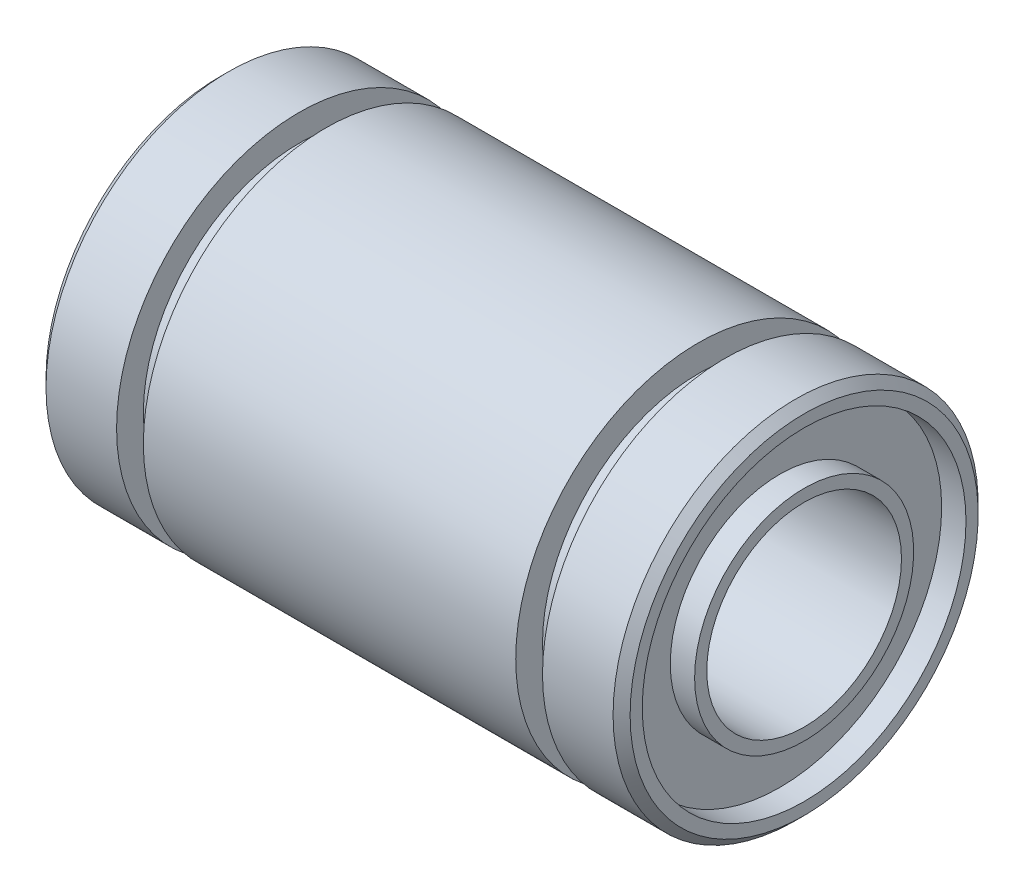
ISO-10303-21;
HEADER;
FILE_DESCRIPTION(('STEP AP214'),'2;1');
FILE_NAME('part.step','',(''),(''),'','','');
FILE_SCHEMA(('AUTOMOTIVE_DESIGN { 1 0 10303 214 1 1 1 1 }'));
ENDSEC;
DATA;
#1=APPLICATION_CONTEXT('core data for automotive mechanical design processes');
#2=APPLICATION_PROTOCOL_DEFINITION('international standard','automotive_design',2000,#1);
#3=PRODUCT_CONTEXT('',#1,'mechanical');
#4=PRODUCT('Part','Part','',(#3));
#5=PRODUCT_RELATED_PRODUCT_CATEGORY('part','',(#4));
#6=PRODUCT_DEFINITION_FORMATION('','',#4);
#7=PRODUCT_DEFINITION_CONTEXT('part definition',#1,'design');
#8=PRODUCT_DEFINITION('design','',#6,#7);
#9=PRODUCT_DEFINITION_SHAPE('','',#8);
#10=(LENGTH_UNIT() NAMED_UNIT(*) SI_UNIT(.MILLI.,.METRE.));
#11=(NAMED_UNIT(*) PLANE_ANGLE_UNIT() SI_UNIT($,.RADIAN.));
#12=(NAMED_UNIT(*) SI_UNIT($,.STERADIAN.) SOLID_ANGLE_UNIT());
#13=UNCERTAINTY_MEASURE_WITH_UNIT(LENGTH_MEASURE(1.E-05),#10,'distance_accuracy_value','');
#14=(GEOMETRIC_REPRESENTATION_CONTEXT(3) GLOBAL_UNCERTAINTY_ASSIGNED_CONTEXT((#13)) GLOBAL_UNIT_ASSIGNED_CONTEXT((#10,
#11,#12)) REPRESENTATION_CONTEXT('',''));
#15=CARTESIAN_POINT('',(0.,0.,0.));
#16=DIRECTION('',(0.,0.,1.));
#17=DIRECTION('',(1.,0.,0.));
#18=AXIS2_PLACEMENT_3D('',#15,#16,#17);
#19=CARTESIAN_POINT('',(11.65,0.,0.));
#20=DIRECTION('',(-1.,0.,0.));
#21=DIRECTION('',(0.,0.,1.));
#22=AXIS2_PLACEMENT_3D('',#19,#20,#21);
#23=CONICAL_SURFACE('',#22,7.5,0.78539816339745);
#24=CARTESIAN_POINT('',(12.,0.,0.));
#25=DIRECTION('',(-1.,0.,0.));
#26=DIRECTION('',(0.,0.,1.));
#27=AXIS2_PLACEMENT_3D('',#24,#25,#26);
#28=CIRCLE('',#27,7.15);
#29=CARTESIAN_POINT('',(12.,0.,7.15));
#30=VERTEX_POINT('',#29);
#31=EDGE_CURVE('E116',#30,#30,#28,.T.);
#32=ORIENTED_EDGE('',*,*,#31,.T.);
#33=EDGE_LOOP('',(#32));
#34=FACE_BOUND('',#33,.T.);
#35=CARTESIAN_POINT('',(11.65,0.,0.));
#36=DIRECTION('',(-1.,0.,0.));
#37=DIRECTION('',(0.,0.,1.));
#38=AXIS2_PLACEMENT_3D('',#35,#36,#37);
#39=CIRCLE('',#38,7.5);
#40=CARTESIAN_POINT('',(11.65,0.,7.5));
#41=VERTEX_POINT('',#40);
#42=EDGE_CURVE('E12',#41,#41,#39,.T.);
#43=ORIENTED_EDGE('',*,*,#42,.F.);
#44=EDGE_LOOP('',(#43));
#45=FACE_BOUND('',#44,.T.);
#46=ADVANCED_FACE('F46',(#34,#45),#23,.T.);
#47=CARTESIAN_POINT('',(-45.6895053247726,0.,0.));
#48=DIRECTION('',(-1.,0.,0.));
#49=DIRECTION('',(0.,0.,1.));
#50=AXIS2_PLACEMENT_3D('',#47,#48,#49);
#51=CYLINDRICAL_SURFACE('',#50,7.5);
#52=CARTESIAN_POINT('',(8.75000000000001,0.,0.));
#53=DIRECTION('',(-1.,0.,0.));
#54=DIRECTION('',(0.,0.,1.));
#55=AXIS2_PLACEMENT_3D('',#52,#53,#54);
#56=CIRCLE('',#55,7.5);
#57=CARTESIAN_POINT('',(8.75000000000001,0.,7.5));
#58=VERTEX_POINT('',#57);
#59=EDGE_CURVE('E52',#58,#58,#56,.T.);
#60=ORIENTED_EDGE('',*,*,#59,.F.);
#61=EDGE_LOOP('',(#60));
#62=FACE_BOUND('',#61,.T.);
#63=ORIENTED_EDGE('',*,*,#42,.T.);
#64=EDGE_LOOP('',(#63));
#65=FACE_BOUND('',#64,.T.);
#66=ADVANCED_FACE('F134',(#62,#65),#51,.T.);
#67=CARTESIAN_POINT('',(8.75000000000001,0.,0.));
#68=DIRECTION('',(1.,0.,0.));
#69=DIRECTION('',(0.,0.,-1.));
#70=AXIS2_PLACEMENT_3D('',#67,#68,#69);
#71=PLANE('',#70);
#72=CARTESIAN_POINT('',(8.75000000000001,0.,0.));
#73=DIRECTION('',(-1.,0.,0.));
#74=DIRECTION('',(0.,0.,1.));
#75=AXIS2_PLACEMENT_3D('',#72,#73,#74);
#76=CIRCLE('',#75,6.4);
#77=CARTESIAN_POINT('',(8.75000000000001,0.,6.4));
#78=VERTEX_POINT('',#77);
#79=EDGE_CURVE('E56',#78,#78,#76,.T.);
#80=ORIENTED_EDGE('',*,*,#79,.F.);
#81=EDGE_LOOP('',(#80));
#82=FACE_BOUND('',#81,.T.);
#83=ORIENTED_EDGE('',*,*,#59,.T.);
#84=EDGE_LOOP('',(#83));
#85=FACE_BOUND('',#84,.T.);
#86=ADVANCED_FACE('F138',(#82,#85),#71,.F.);
#87=CARTESIAN_POINT('',(-45.6895053247726,0.,0.));
#88=DIRECTION('',(-1.,0.,0.));
#89=DIRECTION('',(0.,0.,1.));
#90=AXIS2_PLACEMENT_3D('',#87,#88,#89);
#91=CYLINDRICAL_SURFACE('',#90,6.4);
#92=CARTESIAN_POINT('',(7.65,0.,0.));
#93=DIRECTION('',(-1.,0.,0.));
#94=DIRECTION('',(0.,0.,1.));
#95=AXIS2_PLACEMENT_3D('',#92,#93,#94);
#96=CIRCLE('',#95,6.4);
#97=CARTESIAN_POINT('',(7.65,0.,6.4));
#98=VERTEX_POINT('',#97);
#99=EDGE_CURVE('E60',#98,#98,#96,.T.);
#100=ORIENTED_EDGE('',*,*,#99,.F.);
#101=EDGE_LOOP('',(#100));
#102=FACE_BOUND('',#101,.T.);
#103=ORIENTED_EDGE('',*,*,#79,.T.);
#104=EDGE_LOOP('',(#103));
#105=FACE_BOUND('',#104,.T.);
#106=ADVANCED_FACE('F143',(#102,#105),#91,.T.);
#107=CARTESIAN_POINT('',(7.65,0.,0.));
#108=DIRECTION('',(-1.,0.,0.));
#109=DIRECTION('',(0.,0.,1.));
#110=AXIS2_PLACEMENT_3D('',#107,#108,#109);
#111=PLANE('',#110);
#112=CARTESIAN_POINT('',(7.65,0.,0.));
#113=DIRECTION('',(-1.,0.,0.));
#114=DIRECTION('',(0.,0.,1.));
#115=AXIS2_PLACEMENT_3D('',#112,#113,#114);
#116=CIRCLE('',#115,7.5);
#117=CARTESIAN_POINT('',(7.65,0.,7.5));
#118=VERTEX_POINT('',#117);
#119=EDGE_CURVE('E65',#118,#118,#116,.T.);
#120=ORIENTED_EDGE('',*,*,#119,.F.);
#121=EDGE_LOOP('',(#120));
#122=FACE_BOUND('',#121,.T.);
#123=ORIENTED_EDGE('',*,*,#99,.T.);
#124=EDGE_LOOP('',(#123));
#125=FACE_BOUND('',#124,.T.);
#126=ADVANCED_FACE('F149',(#122,#125),#111,.F.);
#127=CARTESIAN_POINT('',(-45.6895053247726,0.,0.));
#128=DIRECTION('',(-1.,0.,0.));
#129=DIRECTION('',(0.,0.,1.));
#130=AXIS2_PLACEMENT_3D('',#127,#128,#129);
#131=CYLINDRICAL_SURFACE('',#130,7.5);
#132=ORIENTED_EDGE('',*,*,#119,.T.);
#133=EDGE_LOOP('',(#132));
#134=FACE_BOUND('',#133,.T.);
#135=CARTESIAN_POINT('',(-7.65,0.,0.));
#136=DIRECTION('',(-1.,0.,0.));
#137=DIRECTION('',(0.,0.,1.));
#138=AXIS2_PLACEMENT_3D('',#135,#136,#137);
#139=CIRCLE('',#138,7.5);
#140=CARTESIAN_POINT('',(-7.65,0.,7.5));
#141=VERTEX_POINT('',#140);
#142=EDGE_CURVE('E68',#141,#141,#139,.T.);
#143=ORIENTED_EDGE('',*,*,#142,.F.);
#144=EDGE_LOOP('',(#143));
#145=FACE_BOUND('',#144,.T.);
#146=ADVANCED_FACE('F153',(#134,#145),#131,.T.);
#147=CARTESIAN_POINT('',(-7.65,0.,0.));
#148=DIRECTION('',(-1.,0.,0.));
#149=DIRECTION('',(0.,0.,1.));
#150=AXIS2_PLACEMENT_3D('',#147,#148,#149);
#151=PLANE('',#150);
#152=ORIENTED_EDGE('',*,*,#142,.T.);
#153=EDGE_LOOP('',(#152));
#154=FACE_BOUND('',#153,.T.);
#155=CARTESIAN_POINT('',(-7.65,0.,0.));
#156=DIRECTION('',(-1.,0.,0.));
#157=DIRECTION('',(0.,0.,1.));
#158=AXIS2_PLACEMENT_3D('',#155,#156,#157);
#159=CIRCLE('',#158,6.4);
#160=CARTESIAN_POINT('',(-7.65,0.,6.4));
#161=VERTEX_POINT('',#160);
#162=EDGE_CURVE('E71',#161,#161,#159,.T.);
#163=ORIENTED_EDGE('',*,*,#162,.F.);
#164=EDGE_LOOP('',(#163));
#165=FACE_BOUND('',#164,.T.);
#166=ADVANCED_FACE('F157',(#154,#165),#151,.T.);
#167=CARTESIAN_POINT('',(-45.6895053247726,0.,0.));
#168=DIRECTION('',(-1.,0.,0.));
#169=DIRECTION('',(0.,0.,1.));
#170=AXIS2_PLACEMENT_3D('',#167,#168,#169);
#171=CYLINDRICAL_SURFACE('',#170,6.4);
#172=ORIENTED_EDGE('',*,*,#162,.T.);
#173=EDGE_LOOP('',(#172));
#174=FACE_BOUND('',#173,.T.);
#175=CARTESIAN_POINT('',(-8.74999999999999,0.,0.));
#176=DIRECTION('',(-1.,0.,0.));
#177=DIRECTION('',(0.,0.,1.));
#178=AXIS2_PLACEMENT_3D('',#175,#176,#177);
#179=CIRCLE('',#178,6.4);
#180=CARTESIAN_POINT('',(-8.74999999999999,0.,6.4));
#181=VERTEX_POINT('',#180);
#182=EDGE_CURVE('E74',#181,#181,#179,.T.);
#183=ORIENTED_EDGE('',*,*,#182,.F.);
#184=EDGE_LOOP('',(#183));
#185=FACE_BOUND('',#184,.T.);
#186=ADVANCED_FACE('F161',(#174,#185),#171,.T.);
#187=CARTESIAN_POINT('',(-8.75,0.,0.));
#188=DIRECTION('',(1.,0.,0.));
#189=DIRECTION('',(0.,0.,-1.));
#190=AXIS2_PLACEMENT_3D('',#187,#188,#189);
#191=PLANE('',#190);
#192=ORIENTED_EDGE('',*,*,#182,.T.);
#193=EDGE_LOOP('',(#192));
#194=FACE_BOUND('',#193,.T.);
#195=CARTESIAN_POINT('',(-8.74999999999999,0.,0.));
#196=DIRECTION('',(-1.,0.,0.));
#197=DIRECTION('',(0.,0.,1.));
#198=AXIS2_PLACEMENT_3D('',#195,#196,#197);
#199=CIRCLE('',#198,7.5);
#200=CARTESIAN_POINT('',(-8.74999999999999,0.,7.5));
#201=VERTEX_POINT('',#200);
#202=EDGE_CURVE('E77',#201,#201,#199,.T.);
#203=ORIENTED_EDGE('',*,*,#202,.F.);
#204=EDGE_LOOP('',(#203));
#205=FACE_BOUND('',#204,.T.);
#206=ADVANCED_FACE('F165',(#194,#205),#191,.T.);
#207=CARTESIAN_POINT('',(-45.6895053247726,0.,0.));
#208=DIRECTION('',(-1.,0.,0.));
#209=DIRECTION('',(0.,0.,1.));
#210=AXIS2_PLACEMENT_3D('',#207,#208,#209);
#211=CYLINDRICAL_SURFACE('',#210,7.5);
#212=ORIENTED_EDGE('',*,*,#202,.T.);
#213=EDGE_LOOP('',(#212));
#214=FACE_BOUND('',#213,.T.);
#215=CARTESIAN_POINT('',(-11.65,0.,0.));
#216=DIRECTION('',(-1.,0.,0.));
#217=DIRECTION('',(0.,0.,1.));
#218=AXIS2_PLACEMENT_3D('',#215,#216,#217);
#219=CIRCLE('',#218,7.5);
#220=CARTESIAN_POINT('',(-11.65,0.,7.5));
#221=VERTEX_POINT('',#220);
#222=EDGE_CURVE('E80',#221,#221,#219,.T.);
#223=ORIENTED_EDGE('',*,*,#222,.F.);
#224=EDGE_LOOP('',(#223));
#225=FACE_BOUND('',#224,.T.);
#226=ADVANCED_FACE('F169',(#214,#225),#211,.T.);
#227=CARTESIAN_POINT('',(-11.65,0.,0.));
#228=DIRECTION('',(1.,0.,0.));
#229=DIRECTION('',(0.,0.,-1.));
#230=AXIS2_PLACEMENT_3D('',#227,#228,#229);
#231=CONICAL_SURFACE('',#230,7.5,0.78539816339745);
#232=CARTESIAN_POINT('',(-12.,0.,0.));
#233=DIRECTION('',(-1.,0.,0.));
#234=DIRECTION('',(0.,0.,1.));
#235=AXIS2_PLACEMENT_3D('',#232,#233,#234);
#236=CIRCLE('',#235,7.15);
#237=CARTESIAN_POINT('',(-12.,0.,7.15));
#238=VERTEX_POINT('',#237);
#239=EDGE_CURVE('E83',#238,#238,#236,.T.);
#240=ORIENTED_EDGE('',*,*,#239,.F.);
#241=EDGE_LOOP('',(#240));
#242=FACE_BOUND('',#241,.T.);
#243=ORIENTED_EDGE('',*,*,#222,.T.);
#244=EDGE_LOOP('',(#243));
#245=FACE_BOUND('',#244,.T.);
#246=ADVANCED_FACE('F173',(#242,#245),#231,.T.);
#247=CARTESIAN_POINT('',(-12.,0.,0.));
#248=DIRECTION('',(1.,0.,0.));
#249=DIRECTION('',(0.,0.,-1.));
#250=AXIS2_PLACEMENT_3D('',#247,#248,#249);
#251=PLANE('',#250);
#252=CARTESIAN_POINT('',(-12.,0.,0.));
#253=DIRECTION('',(-1.,0.,0.));
#254=DIRECTION('',(0.,0.,1.));
#255=AXIS2_PLACEMENT_3D('',#252,#253,#254);
#256=CIRCLE('',#255,6.65);
#257=CARTESIAN_POINT('',(-12.,0.,6.65));
#258=VERTEX_POINT('',#257);
#259=EDGE_CURVE('E86',#258,#258,#256,.T.);
#260=ORIENTED_EDGE('',*,*,#259,.F.);
#261=EDGE_LOOP('',(#260));
#262=FACE_BOUND('',#261,.T.);
#263=ORIENTED_EDGE('',*,*,#239,.T.);
#264=EDGE_LOOP('',(#263));
#265=FACE_BOUND('',#264,.T.);
#266=ADVANCED_FACE('F177',(#262,#265),#251,.F.);
#267=CARTESIAN_POINT('',(-45.6895053247726,0.,0.));
#268=DIRECTION('',(-1.,0.,0.));
#269=DIRECTION('',(0.,0.,1.));
#270=AXIS2_PLACEMENT_3D('',#267,#268,#269);
#271=CYLINDRICAL_SURFACE('',#270,6.65);
#272=CARTESIAN_POINT('',(-11.,0.,0.));
#273=DIRECTION('',(-1.,0.,0.));
#274=DIRECTION('',(0.,0.,1.));
#275=AXIS2_PLACEMENT_3D('',#272,#273,#274);
#276=CIRCLE('',#275,6.65);
#277=CARTESIAN_POINT('',(-11.,0.,6.65));
#278=VERTEX_POINT('',#277);
#279=EDGE_CURVE('E89',#278,#278,#276,.T.);
#280=ORIENTED_EDGE('',*,*,#279,.F.);
#281=EDGE_LOOP('',(#280));
#282=FACE_BOUND('',#281,.T.);
#283=ORIENTED_EDGE('',*,*,#259,.T.);
#284=EDGE_LOOP('',(#283));
#285=FACE_BOUND('',#284,.T.);
#286=ADVANCED_FACE('F181',(#282,#285),#271,.F.);
#287=CARTESIAN_POINT('',(-11.,0.,0.));
#288=DIRECTION('',(1.,0.,0.));
#289=DIRECTION('',(0.,0.,-1.));
#290=AXIS2_PLACEMENT_3D('',#287,#288,#289);
#291=PLANE('',#290);
#292=CARTESIAN_POINT('',(-11.,0.,0.));
#293=DIRECTION('',(-1.,0.,0.));
#294=DIRECTION('',(0.,0.,1.));
#295=AXIS2_PLACEMENT_3D('',#292,#293,#294);
#296=CIRCLE('',#295,4.5);
#297=CARTESIAN_POINT('',(-11.,0.,4.5));
#298=VERTEX_POINT('',#297);
#299=EDGE_CURVE('E92',#298,#298,#296,.T.);
#300=ORIENTED_EDGE('',*,*,#299,.F.);
#301=EDGE_LOOP('',(#300));
#302=FACE_BOUND('',#301,.T.);
#303=ORIENTED_EDGE('',*,*,#279,.T.);
#304=EDGE_LOOP('',(#303));
#305=FACE_BOUND('',#304,.T.);
#306=ADVANCED_FACE('F185',(#302,#305),#291,.F.);
#307=CARTESIAN_POINT('',(-45.6895053247726,0.,0.));
#308=DIRECTION('',(-1.,0.,0.));
#309=DIRECTION('',(0.,0.,1.));
#310=AXIS2_PLACEMENT_3D('',#307,#308,#309);
#311=CYLINDRICAL_SURFACE('',#310,4.5);
#312=CARTESIAN_POINT('',(-12.,0.,0.));
#313=DIRECTION('',(-1.,0.,0.));
#314=DIRECTION('',(0.,0.,1.));
#315=AXIS2_PLACEMENT_3D('',#312,#313,#314);
#316=CIRCLE('',#315,4.5);
#317=CARTESIAN_POINT('',(-12.,0.,4.5));
#318=VERTEX_POINT('',#317);
#319=EDGE_CURVE('E95',#318,#318,#316,.T.);
#320=ORIENTED_EDGE('',*,*,#319,.F.);
#321=EDGE_LOOP('',(#320));
#322=FACE_BOUND('',#321,.T.);
#323=ORIENTED_EDGE('',*,*,#299,.T.);
#324=EDGE_LOOP('',(#323));
#325=FACE_BOUND('',#324,.T.);
#326=ADVANCED_FACE('F189',(#322,#325),#311,.T.);
#327=CARTESIAN_POINT('',(-12.,0.,0.));
#328=DIRECTION('',(1.,0.,0.));
#329=DIRECTION('',(0.,0.,-1.));
#330=AXIS2_PLACEMENT_3D('',#327,#328,#329);
#331=PLANE('',#330);
#332=CARTESIAN_POINT('',(-12.,0.,0.));
#333=DIRECTION('',(-1.,0.,0.));
#334=DIRECTION('',(0.,0.,1.));
#335=AXIS2_PLACEMENT_3D('',#332,#333,#334);
#336=CIRCLE('',#335,4.);
#337=CARTESIAN_POINT('',(-12.,0.,4.));
#338=VERTEX_POINT('',#337);
#339=EDGE_CURVE('E98',#338,#338,#336,.T.);
#340=ORIENTED_EDGE('',*,*,#339,.F.);
#341=EDGE_LOOP('',(#340));
#342=FACE_BOUND('',#341,.T.);
#343=ORIENTED_EDGE('',*,*,#319,.T.);
#344=EDGE_LOOP('',(#343));
#345=FACE_BOUND('',#344,.T.);
#346=ADVANCED_FACE('F193',(#342,#345),#331,.F.);
#347=CARTESIAN_POINT('',(-45.6895053247726,0.,0.));
#348=DIRECTION('',(-1.,0.,0.));
#349=DIRECTION('',(0.,0.,1.));
#350=AXIS2_PLACEMENT_3D('',#347,#348,#349);
#351=CYLINDRICAL_SURFACE('',#350,4.);
#352=CARTESIAN_POINT('',(12.,0.,0.));
#353=DIRECTION('',(-1.,0.,0.));
#354=DIRECTION('',(0.,0.,1.));
#355=AXIS2_PLACEMENT_3D('',#352,#353,#354);
#356=CIRCLE('',#355,4.);
#357=CARTESIAN_POINT('',(12.,0.,4.));
#358=VERTEX_POINT('',#357);
#359=EDGE_CURVE('E101',#358,#358,#356,.T.);
#360=ORIENTED_EDGE('',*,*,#359,.F.);
#361=EDGE_LOOP('',(#360));
#362=FACE_BOUND('',#361,.T.);
#363=ORIENTED_EDGE('',*,*,#339,.T.);
#364=EDGE_LOOP('',(#363));
#365=FACE_BOUND('',#364,.T.);
#366=ADVANCED_FACE('F197',(#362,#365),#351,.F.);
#367=CARTESIAN_POINT('',(12.,0.,0.));
#368=DIRECTION('',(1.,0.,0.));
#369=DIRECTION('',(0.,0.,-1.));
#370=AXIS2_PLACEMENT_3D('',#367,#368,#369);
#371=PLANE('',#370);
#372=ORIENTED_EDGE('',*,*,#359,.T.);
#373=EDGE_LOOP('',(#372));
#374=FACE_BOUND('',#373,.T.);
#375=CARTESIAN_POINT('',(12.,0.,0.));
#376=DIRECTION('',(-1.,0.,0.));
#377=DIRECTION('',(0.,0.,1.));
#378=AXIS2_PLACEMENT_3D('',#375,#376,#377);
#379=CIRCLE('',#378,4.5);
#380=CARTESIAN_POINT('',(12.,0.,4.5));
#381=VERTEX_POINT('',#380);
#382=EDGE_CURVE('E104',#381,#381,#379,.T.);
#383=ORIENTED_EDGE('',*,*,#382,.F.);
#384=EDGE_LOOP('',(#383));
#385=FACE_BOUND('',#384,.T.);
#386=ADVANCED_FACE('F201',(#374,#385),#371,.T.);
#387=CARTESIAN_POINT('',(-45.6895053247726,0.,0.));
#388=DIRECTION('',(-1.,0.,0.));
#389=DIRECTION('',(0.,0.,1.));
#390=AXIS2_PLACEMENT_3D('',#387,#388,#389);
#391=CYLINDRICAL_SURFACE('',#390,4.5);
#392=ORIENTED_EDGE('',*,*,#382,.T.);
#393=EDGE_LOOP('',(#392));
#394=FACE_BOUND('',#393,.T.);
#395=CARTESIAN_POINT('',(11.,0.,0.));
#396=DIRECTION('',(-1.,0.,0.));
#397=DIRECTION('',(0.,0.,1.));
#398=AXIS2_PLACEMENT_3D('',#395,#396,#397);
#399=CIRCLE('',#398,4.5);
#400=CARTESIAN_POINT('',(11.,0.,4.5));
#401=VERTEX_POINT('',#400);
#402=EDGE_CURVE('E107',#401,#401,#399,.T.);
#403=ORIENTED_EDGE('',*,*,#402,.F.);
#404=EDGE_LOOP('',(#403));
#405=FACE_BOUND('',#404,.T.);
#406=ADVANCED_FACE('F205',(#394,#405),#391,.T.);
#407=CARTESIAN_POINT('',(11.,0.,0.));
#408=DIRECTION('',(1.,0.,0.));
#409=DIRECTION('',(0.,0.,-1.));
#410=AXIS2_PLACEMENT_3D('',#407,#408,#409);
#411=PLANE('',#410);
#412=ORIENTED_EDGE('',*,*,#402,.T.);
#413=EDGE_LOOP('',(#412));
#414=FACE_BOUND('',#413,.T.);
#415=CARTESIAN_POINT('',(11.,0.,0.));
#416=DIRECTION('',(-1.,0.,0.));
#417=DIRECTION('',(0.,0.,1.));
#418=AXIS2_PLACEMENT_3D('',#415,#416,#417);
#419=CIRCLE('',#418,6.65);
#420=CARTESIAN_POINT('',(11.,0.,6.65));
#421=VERTEX_POINT('',#420);
#422=EDGE_CURVE('E110',#421,#421,#419,.T.);
#423=ORIENTED_EDGE('',*,*,#422,.F.);
#424=EDGE_LOOP('',(#423));
#425=FACE_BOUND('',#424,.T.);
#426=ADVANCED_FACE('F130',(#414,#425),#411,.T.);
#427=CARTESIAN_POINT('',(-45.6895053247726,0.,0.));
#428=DIRECTION('',(-1.,0.,0.));
#429=DIRECTION('',(0.,0.,1.));
#430=AXIS2_PLACEMENT_3D('',#427,#428,#429);
#431=CYLINDRICAL_SURFACE('',#430,6.65);
#432=ORIENTED_EDGE('',*,*,#422,.T.);
#433=EDGE_LOOP('',(#432));
#434=FACE_BOUND('',#433,.T.);
#435=CARTESIAN_POINT('',(12.,0.,0.));
#436=DIRECTION('',(-1.,0.,0.));
#437=DIRECTION('',(0.,0.,1.));
#438=AXIS2_PLACEMENT_3D('',#435,#436,#437);
#439=CIRCLE('',#438,6.65);
#440=CARTESIAN_POINT('',(12.,0.,6.65));
#441=VERTEX_POINT('',#440);
#442=EDGE_CURVE('E113',#441,#441,#439,.T.);
#443=ORIENTED_EDGE('',*,*,#442,.F.);
#444=EDGE_LOOP('',(#443));
#445=FACE_BOUND('',#444,.T.);
#446=ADVANCED_FACE('F124',(#434,#445),#431,.F.);
#447=CARTESIAN_POINT('',(12.,0.,0.));
#448=DIRECTION('',(1.,0.,0.));
#449=DIRECTION('',(0.,0.,-1.));
#450=AXIS2_PLACEMENT_3D('',#447,#448,#449);
#451=PLANE('',#450);
#452=ORIENTED_EDGE('',*,*,#442,.T.);
#453=EDGE_LOOP('',(#452));
#454=FACE_BOUND('',#453,.T.);
#455=ORIENTED_EDGE('',*,*,#31,.F.);
#456=EDGE_LOOP('',(#455));
#457=FACE_BOUND('',#456,.T.);
#458=ADVANCED_FACE('F122',(#454,#457),#451,.T.);
#459=CLOSED_SHELL('',(#46,#66,#86,#106,#126,#146,#166,#186,#206,#226,#246,#266,#286,#306,#326,
#346,#366,#386,#406,#426,#446,#458));
#460=MANIFOLD_SOLID_BREP('B2',#459);
#461=ADVANCED_BREP_SHAPE_REPRESENTATION('',(#18,#460),#14);
#462=SHAPE_DEFINITION_REPRESENTATION(#9,#461);
ENDSEC;
END-ISO-10303-21;
